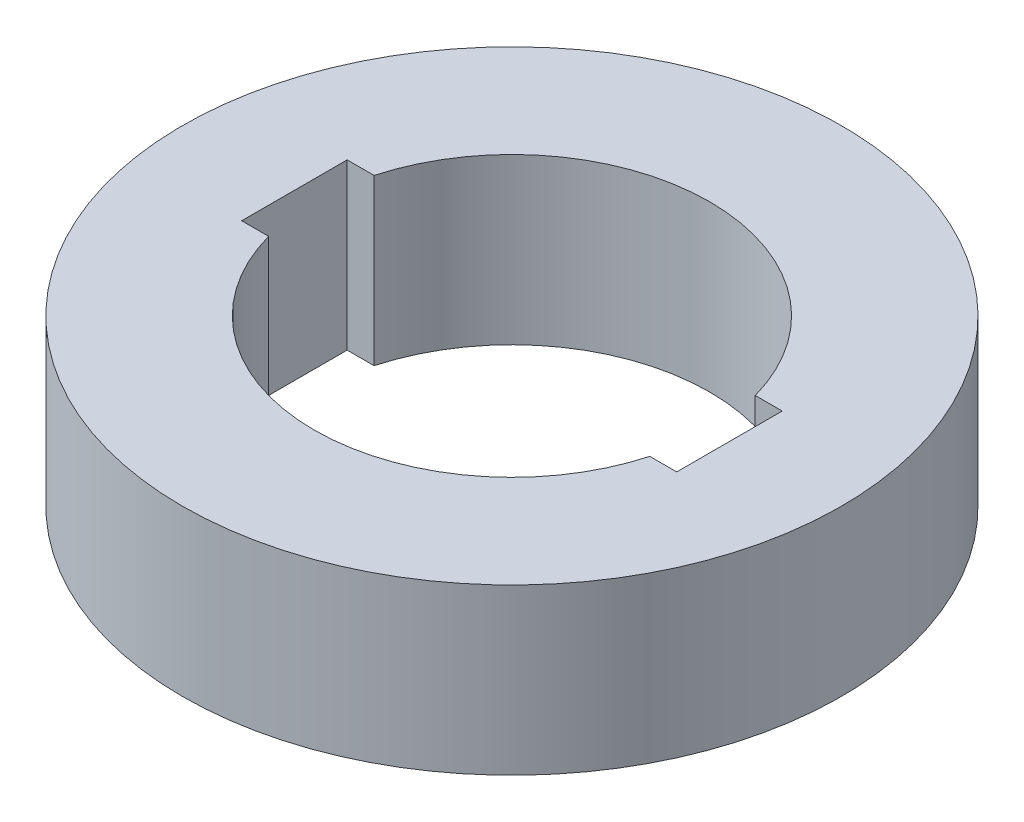
ISO-10303-21;
HEADER;
FILE_DESCRIPTION(('STEP AP214'),'2;1');
FILE_NAME('part.step','',(''),(''),'','','');
FILE_SCHEMA(('AUTOMOTIVE_DESIGN { 1 0 10303 214 1 1 1 1 }'));
ENDSEC;
DATA;
#1=APPLICATION_CONTEXT('core data for automotive mechanical design processes');
#2=APPLICATION_PROTOCOL_DEFINITION('international standard','automotive_design',2000,#1);
#3=PRODUCT_CONTEXT('',#1,'mechanical');
#4=PRODUCT('Part','Part','',(#3));
#5=PRODUCT_RELATED_PRODUCT_CATEGORY('part','',(#4));
#6=PRODUCT_DEFINITION_FORMATION('','',#4);
#7=PRODUCT_DEFINITION_CONTEXT('part definition',#1,'design');
#8=PRODUCT_DEFINITION('design','',#6,#7);
#9=PRODUCT_DEFINITION_SHAPE('','',#8);
#10=(LENGTH_UNIT() NAMED_UNIT(*) SI_UNIT(.MILLI.,.METRE.));
#11=(NAMED_UNIT(*) PLANE_ANGLE_UNIT() SI_UNIT($,.RADIAN.));
#12=(NAMED_UNIT(*) SI_UNIT($,.STERADIAN.) SOLID_ANGLE_UNIT());
#13=UNCERTAINTY_MEASURE_WITH_UNIT(LENGTH_MEASURE(1.E-05),#10,'distance_accuracy_value','');
#14=(GEOMETRIC_REPRESENTATION_CONTEXT(3) GLOBAL_UNCERTAINTY_ASSIGNED_CONTEXT((#13)) GLOBAL_UNIT_ASSIGNED_CONTEXT((#10,
#11,#12)) REPRESENTATION_CONTEXT('',''));
#15=CARTESIAN_POINT('',(0.,0.,0.));
#16=DIRECTION('',(0.,0.,1.));
#17=DIRECTION('',(1.,0.,0.));
#18=AXIS2_PLACEMENT_3D('',#15,#16,#17);
#19=CARTESIAN_POINT('',(0.,25.,0.));
#20=DIRECTION('',(0.,-1.,0.));
#21=DIRECTION('',(0.,0.,-1.));
#22=AXIS2_PLACEMENT_3D('',#19,#20,#21);
#23=CYLINDRICAL_SURFACE('',#22,30.);
#24=CARTESIAN_POINT('',(0.,0.,0.));
#25=DIRECTION('',(0.,1.,0.));
#26=DIRECTION('',(0.,0.,1.));
#27=AXIS2_PLACEMENT_3D('',#24,#25,#26);
#28=CIRCLE('',#27,30.);
#29=CARTESIAN_POINT('',(28.9136645896019,0.,-8.));
#30=VERTEX_POINT('',#29);
#31=CARTESIAN_POINT('',(-28.9136645896019,0.,-8.));
#32=VERTEX_POINT('',#31);
#33=EDGE_CURVE('E196',#30,#32,#28,.T.);
#34=ORIENTED_EDGE('',*,*,#33,.F.);
#35=DIRECTION('',(0.,-1.,0.));
#36=VECTOR('',#35,1.);
#37=CARTESIAN_POINT('',(28.9136645896019,25.,-8.));
#38=LINE('',#37,#36);
#39=CARTESIAN_POINT('',(28.9136645896019,25.,-8.));
#40=VERTEX_POINT('',#39);
#41=EDGE_CURVE('E11',#40,#30,#38,.T.);
#42=ORIENTED_EDGE('',*,*,#41,.F.);
#43=CARTESIAN_POINT('',(0.,25.,0.));
#44=DIRECTION('',(0.,1.,0.));
#45=DIRECTION('',(0.,0.,1.));
#46=AXIS2_PLACEMENT_3D('',#43,#44,#45);
#47=CIRCLE('',#46,30.);
#48=CARTESIAN_POINT('',(-28.9136645896019,25.,-8.));
#49=VERTEX_POINT('',#48);
#50=EDGE_CURVE('E144',#40,#49,#47,.T.);
#51=ORIENTED_EDGE('',*,*,#50,.T.);
#52=DIRECTION('',(0.,-1.,0.));
#53=VECTOR('',#52,1.);
#54=CARTESIAN_POINT('',(-28.9136645896019,25.,-8.));
#55=LINE('',#54,#53);
#56=EDGE_CURVE('E97',#49,#32,#55,.T.);
#57=ORIENTED_EDGE('',*,*,#56,.T.);
#58=EDGE_LOOP('',(#34,#42,#51,#57));
#59=FACE_BOUND('',#58,.T.);
#60=ADVANCED_FACE('F45',(#59),#23,.F.);
#61=CARTESIAN_POINT('',(0.,25.,-8.));
#62=DIRECTION('',(0.,0.,-1.));
#63=DIRECTION('',(-1.,0.,0.));
#64=AXIS2_PLACEMENT_3D('',#61,#62,#63);
#65=PLANE('',#64);
#66=DIRECTION('',(1.,0.,0.));
#67=VECTOR('',#66,1.);
#68=CARTESIAN_POINT('',(0.,0.,-8.));
#69=LINE('',#68,#67);
#70=CARTESIAN_POINT('',(33.,0.,-8.));
#71=VERTEX_POINT('',#70);
#72=EDGE_CURVE('E167',#30,#71,#69,.T.);
#73=ORIENTED_EDGE('',*,*,#72,.T.);
#74=DIRECTION('',(0.,-1.,0.));
#75=VECTOR('',#74,1.);
#76=CARTESIAN_POINT('',(33.,25.,-8.));
#77=LINE('',#76,#75);
#78=CARTESIAN_POINT('',(33.,25.,-8.));
#79=VERTEX_POINT('',#78);
#80=EDGE_CURVE('E55',#79,#71,#77,.T.);
#81=ORIENTED_EDGE('',*,*,#80,.F.);
#82=DIRECTION('',(1.,0.,0.));
#83=VECTOR('',#82,1.);
#84=CARTESIAN_POINT('',(0.,25.,-8.));
#85=LINE('',#84,#83);
#86=EDGE_CURVE('E152',#40,#79,#85,.T.);
#87=ORIENTED_EDGE('',*,*,#86,.F.);
#88=ORIENTED_EDGE('',*,*,#41,.T.);
#89=EDGE_LOOP('',(#73,#81,#87,#88));
#90=FACE_BOUND('',#89,.T.);
#91=ADVANCED_FACE('F192',(#90),#65,.F.);
#92=CARTESIAN_POINT('',(33.,25.,0.));
#93=DIRECTION('',(-1.,0.,0.));
#94=DIRECTION('',(0.,0.,1.));
#95=AXIS2_PLACEMENT_3D('',#92,#93,#94);
#96=PLANE('',#95);
#97=DIRECTION('',(0.,0.,-1.));
#98=VECTOR('',#97,1.);
#99=CARTESIAN_POINT('',(33.,0.,0.));
#100=LINE('',#99,#98);
#101=CARTESIAN_POINT('',(33.,0.,8.));
#102=VERTEX_POINT('',#101);
#103=EDGE_CURVE('E188',#102,#71,#100,.T.);
#104=ORIENTED_EDGE('',*,*,#103,.F.);
#105=DIRECTION('',(0.,-1.,0.));
#106=VECTOR('',#105,1.);
#107=CARTESIAN_POINT('',(33.,25.,8.));
#108=LINE('',#107,#106);
#109=CARTESIAN_POINT('',(33.,25.,8.));
#110=VERTEX_POINT('',#109);
#111=EDGE_CURVE('E181',#110,#102,#108,.T.);
#112=ORIENTED_EDGE('',*,*,#111,.F.);
#113=DIRECTION('',(0.,0.,-1.));
#114=VECTOR('',#113,1.);
#115=CARTESIAN_POINT('',(33.,25.,0.));
#116=LINE('',#115,#114);
#117=EDGE_CURVE('E148',#110,#79,#116,.T.);
#118=ORIENTED_EDGE('',*,*,#117,.T.);
#119=ORIENTED_EDGE('',*,*,#80,.T.);
#120=EDGE_LOOP('',(#104,#112,#118,#119));
#121=FACE_BOUND('',#120,.T.);
#122=ADVANCED_FACE('F47',(#121),#96,.T.);
#123=CARTESIAN_POINT('',(0.,25.,8.));
#124=DIRECTION('',(0.,0.,-1.));
#125=DIRECTION('',(-1.,0.,0.));
#126=AXIS2_PLACEMENT_3D('',#123,#124,#125);
#127=PLANE('',#126);
#128=DIRECTION('',(1.,0.,0.));
#129=VECTOR('',#128,1.);
#130=CARTESIAN_POINT('',(0.,0.,8.));
#131=LINE('',#130,#129);
#132=CARTESIAN_POINT('',(28.9136645896019,0.,8.));
#133=VERTEX_POINT('',#132);
#134=EDGE_CURVE('E201',#133,#102,#131,.T.);
#135=ORIENTED_EDGE('',*,*,#134,.F.);
#136=DIRECTION('',(0.,-1.,0.));
#137=VECTOR('',#136,1.);
#138=CARTESIAN_POINT('',(28.9136645896019,25.,8.));
#139=LINE('',#138,#137);
#140=CARTESIAN_POINT('',(28.9136645896019,25.,8.));
#141=VERTEX_POINT('',#140);
#142=EDGE_CURVE('E178',#141,#133,#139,.T.);
#143=ORIENTED_EDGE('',*,*,#142,.F.);
#144=DIRECTION('',(1.,0.,0.));
#145=VECTOR('',#144,1.);
#146=CARTESIAN_POINT('',(0.,25.,8.));
#147=LINE('',#146,#145);
#148=EDGE_CURVE('E141',#141,#110,#147,.T.);
#149=ORIENTED_EDGE('',*,*,#148,.T.);
#150=ORIENTED_EDGE('',*,*,#111,.T.);
#151=EDGE_LOOP('',(#135,#143,#149,#150));
#152=FACE_BOUND('',#151,.T.);
#153=ADVANCED_FACE('F233',(#152),#127,.T.);
#154=CARTESIAN_POINT('',(-28.9136645896019,0.,8.));
#155=VERTEX_POINT('',#154);
#156=EDGE_CURVE('E205',#155,#133,#28,.T.);
#157=ORIENTED_EDGE('',*,*,#156,.F.);
#158=DIRECTION('',(0.,-1.,0.));
#159=VECTOR('',#158,1.);
#160=CARTESIAN_POINT('',(-28.9136645896019,25.,8.));
#161=LINE('',#160,#159);
#162=CARTESIAN_POINT('',(-28.9136645896019,25.,8.));
#163=VERTEX_POINT('',#162);
#164=EDGE_CURVE('E126',#163,#155,#161,.T.);
#165=ORIENTED_EDGE('',*,*,#164,.F.);
#166=EDGE_CURVE('E138',#163,#141,#47,.T.);
#167=ORIENTED_EDGE('',*,*,#166,.T.);
#168=ORIENTED_EDGE('',*,*,#142,.T.);
#169=EDGE_LOOP('',(#157,#165,#167,#168));
#170=FACE_BOUND('',#169,.T.);
#171=ADVANCED_FACE('F227',(#170),#23,.F.);
#172=CARTESIAN_POINT('',(-33.,0.,8.));
#173=VERTEX_POINT('',#172);
#174=EDGE_CURVE('E124',#173,#155,#131,.T.);
#175=ORIENTED_EDGE('',*,*,#174,.F.);
#176=DIRECTION('',(0.,-1.,0.));
#177=VECTOR('',#176,1.);
#178=CARTESIAN_POINT('',(-33.,25.,8.));
#179=LINE('',#178,#177);
#180=CARTESIAN_POINT('',(-33.,25.,8.));
#181=VERTEX_POINT('',#180);
#182=EDGE_CURVE('E118',#181,#173,#179,.T.);
#183=ORIENTED_EDGE('',*,*,#182,.F.);
#184=EDGE_CURVE('E122',#181,#163,#147,.T.);
#185=ORIENTED_EDGE('',*,*,#184,.T.);
#186=ORIENTED_EDGE('',*,*,#164,.T.);
#187=EDGE_LOOP('',(#175,#183,#185,#186));
#188=FACE_BOUND('',#187,.T.);
#189=ADVANCED_FACE('F120',(#188),#127,.T.);
#190=CARTESIAN_POINT('',(-33.,25.,0.));
#191=DIRECTION('',(-1.,0.,0.));
#192=DIRECTION('',(0.,0.,1.));
#193=AXIS2_PLACEMENT_3D('',#190,#191,#192);
#194=PLANE('',#193);
#195=DIRECTION('',(0.,0.,-1.));
#196=VECTOR('',#195,1.);
#197=CARTESIAN_POINT('',(-33.,0.,0.));
#198=LINE('',#197,#196);
#199=CARTESIAN_POINT('',(-33.,0.,-8.));
#200=VERTEX_POINT('',#199);
#201=EDGE_CURVE('E90',#173,#200,#198,.T.);
#202=ORIENTED_EDGE('',*,*,#201,.T.);
#203=DIRECTION('',(0.,-1.,0.));
#204=VECTOR('',#203,1.);
#205=CARTESIAN_POINT('',(-33.,25.,-8.));
#206=LINE('',#205,#204);
#207=CARTESIAN_POINT('',(-33.,25.,-8.));
#208=VERTEX_POINT('',#207);
#209=EDGE_CURVE('E127',#208,#200,#206,.T.);
#210=ORIENTED_EDGE('',*,*,#209,.F.);
#211=DIRECTION('',(0.,0.,-1.));
#212=VECTOR('',#211,1.);
#213=CARTESIAN_POINT('',(-33.,25.,0.));
#214=LINE('',#213,#212);
#215=EDGE_CURVE('E129',#181,#208,#214,.T.);
#216=ORIENTED_EDGE('',*,*,#215,.F.);
#217=ORIENTED_EDGE('',*,*,#182,.T.);
#218=EDGE_LOOP('',(#202,#210,#216,#217));
#219=FACE_BOUND('',#218,.T.);
#220=ADVANCED_FACE('F130',(#219),#194,.F.);
#221=EDGE_CURVE('E161',#200,#32,#69,.T.);
#222=ORIENTED_EDGE('',*,*,#221,.T.);
#223=ORIENTED_EDGE('',*,*,#56,.F.);
#224=EDGE_CURVE('E63',#208,#49,#85,.T.);
#225=ORIENTED_EDGE('',*,*,#224,.F.);
#226=ORIENTED_EDGE('',*,*,#209,.T.);
#227=EDGE_LOOP('',(#222,#223,#225,#226));
#228=FACE_BOUND('',#227,.T.);
#229=ADVANCED_FACE('F216',(#228),#65,.F.);
#230=CARTESIAN_POINT('',(0.,25.,0.));
#231=DIRECTION('',(0.,-1.,0.));
#232=DIRECTION('',(0.,0.,-1.));
#233=AXIS2_PLACEMENT_3D('',#230,#231,#232);
#234=CYLINDRICAL_SURFACE('',#233,50.);
#235=CARTESIAN_POINT('',(0.,25.,0.));
#236=DIRECTION('',(0.,1.,0.));
#237=DIRECTION('',(0.,0.,1.));
#238=AXIS2_PLACEMENT_3D('',#235,#236,#237);
#239=CIRCLE('',#238,50.);
#240=CARTESIAN_POINT('',(0.,25.,50.));
#241=VERTEX_POINT('',#240);
#242=EDGE_CURVE('E173',#241,#241,#239,.T.);
#243=ORIENTED_EDGE('',*,*,#242,.F.);
#244=EDGE_LOOP('',(#243));
#245=FACE_BOUND('',#244,.T.);
#246=CARTESIAN_POINT('',(0.,0.,0.));
#247=DIRECTION('',(0.,1.,0.));
#248=DIRECTION('',(0.,0.,1.));
#249=AXIS2_PLACEMENT_3D('',#246,#247,#248);
#250=CIRCLE('',#249,50.);
#251=CARTESIAN_POINT('',(0.,0.,50.));
#252=VERTEX_POINT('',#251);
#253=EDGE_CURVE('E158',#252,#252,#250,.T.);
#254=ORIENTED_EDGE('',*,*,#253,.T.);
#255=EDGE_LOOP('',(#254));
#256=FACE_BOUND('',#255,.T.);
#257=ADVANCED_FACE('F214',(#245,#256),#234,.T.);
#258=CARTESIAN_POINT('',(0.,25.,0.));
#259=DIRECTION('',(0.,1.,0.));
#260=DIRECTION('',(0.,0.,1.));
#261=AXIS2_PLACEMENT_3D('',#258,#259,#260);
#262=PLANE('',#261);
#263=ORIENTED_EDGE('',*,*,#50,.F.);
#264=ORIENTED_EDGE('',*,*,#86,.T.);
#265=ORIENTED_EDGE('',*,*,#117,.F.);
#266=ORIENTED_EDGE('',*,*,#148,.F.);
#267=ORIENTED_EDGE('',*,*,#166,.F.);
#268=ORIENTED_EDGE('',*,*,#184,.F.);
#269=ORIENTED_EDGE('',*,*,#215,.T.);
#270=ORIENTED_EDGE('',*,*,#224,.T.);
#271=EDGE_LOOP('',(#263,#264,#265,#266,#267,#268,#269,#270));
#272=FACE_BOUND('',#271,.T.);
#273=ORIENTED_EDGE('',*,*,#242,.T.);
#274=EDGE_LOOP('',(#273));
#275=FACE_BOUND('',#274,.T.);
#276=ADVANCED_FACE('F134',(#272,#275),#262,.T.);
#277=CARTESIAN_POINT('',(0.,0.,0.));
#278=DIRECTION('',(0.,1.,0.));
#279=DIRECTION('',(0.,0.,1.));
#280=AXIS2_PLACEMENT_3D('',#277,#278,#279);
#281=PLANE('',#280);
#282=ORIENTED_EDGE('',*,*,#33,.T.);
#283=ORIENTED_EDGE('',*,*,#221,.F.);
#284=ORIENTED_EDGE('',*,*,#201,.F.);
#285=ORIENTED_EDGE('',*,*,#174,.T.);
#286=ORIENTED_EDGE('',*,*,#156,.T.);
#287=ORIENTED_EDGE('',*,*,#134,.T.);
#288=ORIENTED_EDGE('',*,*,#103,.T.);
#289=ORIENTED_EDGE('',*,*,#72,.F.);
#290=EDGE_LOOP('',(#282,#283,#284,#285,#286,#287,#288,#289));
#291=FACE_BOUND('',#290,.T.);
#292=ORIENTED_EDGE('',*,*,#253,.F.);
#293=EDGE_LOOP('',(#292));
#294=FACE_BOUND('',#293,.T.);
#295=ADVANCED_FACE('F197',(#291,#294),#281,.F.);
#296=CLOSED_SHELL('',(#60,#91,#122,#153,#171,#189,#220,#229,#257,#276,#295));
#297=MANIFOLD_SOLID_BREP('B2',#296);
#298=ADVANCED_BREP_SHAPE_REPRESENTATION('',(#18,#297),#14);
#299=SHAPE_DEFINITION_REPRESENTATION(#9,#298);
ENDSEC;
END-ISO-10303-21;
